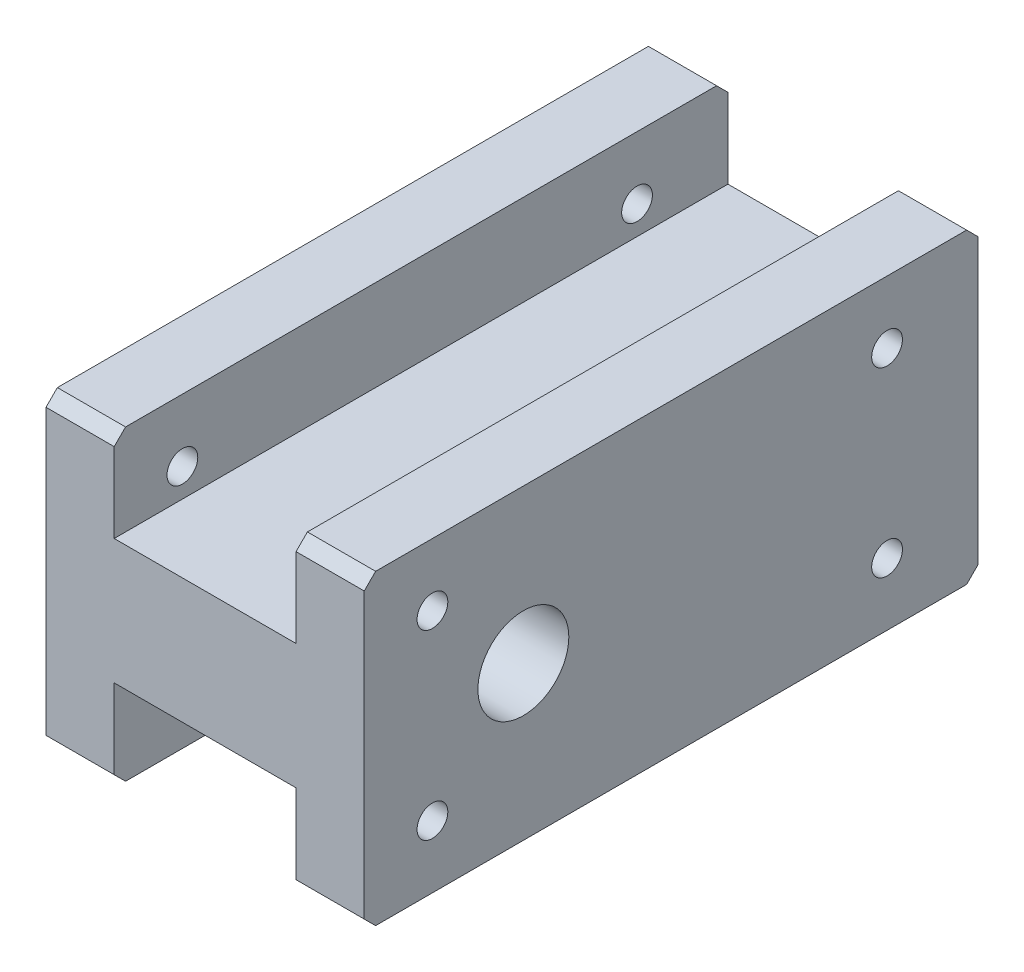
ISO-10303-21;
HEADER;
FILE_DESCRIPTION(('STEP AP214'),'2;1');
FILE_NAME('part.step','',(''),(''),'','','');
FILE_SCHEMA(('AUTOMOTIVE_DESIGN { 1 0 10303 214 1 1 1 1 }'));
ENDSEC;
DATA;
#1=APPLICATION_CONTEXT('core data for automotive mechanical design processes');
#2=APPLICATION_PROTOCOL_DEFINITION('international standard','automotive_design',2000,#1);
#3=PRODUCT_CONTEXT('',#1,'mechanical');
#4=PRODUCT('Part','Part','',(#3));
#5=PRODUCT_RELATED_PRODUCT_CATEGORY('part','',(#4));
#6=PRODUCT_DEFINITION_FORMATION('','',#4);
#7=PRODUCT_DEFINITION_CONTEXT('part definition',#1,'design');
#8=PRODUCT_DEFINITION('design','',#6,#7);
#9=PRODUCT_DEFINITION_SHAPE('','',#8);
#10=(LENGTH_UNIT() NAMED_UNIT(*) SI_UNIT(.MILLI.,.METRE.));
#11=(NAMED_UNIT(*) PLANE_ANGLE_UNIT() SI_UNIT($,.RADIAN.));
#12=(NAMED_UNIT(*) SI_UNIT($,.STERADIAN.) SOLID_ANGLE_UNIT());
#13=UNCERTAINTY_MEASURE_WITH_UNIT(LENGTH_MEASURE(1.E-05),#10,'distance_accuracy_value','');
#14=(GEOMETRIC_REPRESENTATION_CONTEXT(3) GLOBAL_UNCERTAINTY_ASSIGNED_CONTEXT((#13)) GLOBAL_UNIT_ASSIGNED_CONTEXT((#10,
#11,#12)) REPRESENTATION_CONTEXT('',''));
#15=CARTESIAN_POINT('',(0.,0.,0.));
#16=DIRECTION('',(0.,0.,1.));
#17=DIRECTION('',(1.,0.,0.));
#18=AXIS2_PLACEMENT_3D('',#15,#16,#17);
#19=CARTESIAN_POINT('',(-28.,-13.5,14.));
#20=DIRECTION('',(0.,-1.,0.));
#21=DIRECTION('',(0.,0.,-1.));
#22=AXIS2_PLACEMENT_3D('',#19,#20,#21);
#23=PLANE('',#22);
#24=DIRECTION('',(0.,0.,-1.));
#25=VECTOR('',#24,1.);
#26=CARTESIAN_POINT('',(-28.,-13.5,14.));
#27=LINE('',#26,#25);
#28=CARTESIAN_POINT('',(-28.,-13.5,13.));
#29=VERTEX_POINT('',#28);
#30=CARTESIAN_POINT('',(-28.,-13.5,-39.));
#31=VERTEX_POINT('',#30);
#32=EDGE_CURVE('E290',#29,#31,#27,.T.);
#33=ORIENTED_EDGE('',*,*,#32,.T.);
#34=DIRECTION('',(1.,0.,0.));
#35=VECTOR('',#34,1.);
#36=CARTESIAN_POINT('',(-28.,-13.5,-39.));
#37=LINE('',#36,#35);
#38=CARTESIAN_POINT('',(-22.,-13.5,-39.));
#39=VERTEX_POINT('',#38);
#40=EDGE_CURVE('E320',#31,#39,#37,.T.);
#41=ORIENTED_EDGE('',*,*,#40,.T.);
#42=DIRECTION('',(0.,0.,1.));
#43=VECTOR('',#42,1.);
#44=CARTESIAN_POINT('',(-22.,-13.5,-40.));
#45=LINE('',#44,#43);
#46=CARTESIAN_POINT('',(-22.,-13.5,13.));
#47=VERTEX_POINT('',#46);
#48=EDGE_CURVE('E199',#39,#47,#45,.T.);
#49=ORIENTED_EDGE('',*,*,#48,.T.);
#50=DIRECTION('',(-1.,0.,0.));
#51=VECTOR('',#50,1.);
#52=CARTESIAN_POINT('',(-28.,-13.5,13.));
#53=LINE('',#52,#51);
#54=EDGE_CURVE('E300',#47,#29,#53,.T.);
#55=ORIENTED_EDGE('',*,*,#54,.T.);
#56=EDGE_LOOP('',(#33,#41,#49,#55));
#57=FACE_BOUND('',#56,.T.);
#58=ADVANCED_FACE('F34',(#57),#23,.T.);
#59=CARTESIAN_POINT('',(0.,-8.,-32.));
#60=DIRECTION('',(1.,0.,0.));
#61=DIRECTION('',(0.,0.,-1.));
#62=AXIS2_PLACEMENT_3D('',#59,#60,#61);
#63=CYLINDRICAL_SURFACE('',#62,1.35254999999999);
#64=CARTESIAN_POINT('',(-22.,-8.,-32.));
#65=DIRECTION('',(-1.,0.,0.));
#66=DIRECTION('',(0.,0.,1.));
#67=AXIS2_PLACEMENT_3D('',#64,#65,#66);
#68=CIRCLE('',#67,1.35254999999999);
#69=CARTESIAN_POINT('',(-22.,-8.,-30.64745));
#70=VERTEX_POINT('',#69);
#71=EDGE_CURVE('E219',#70,#70,#68,.F.);
#72=ORIENTED_EDGE('',*,*,#71,.T.);
#73=EDGE_LOOP('',(#72));
#74=FACE_BOUND('',#73,.T.);
#75=CARTESIAN_POINT('',(-28.,-8.,-32.));
#76=DIRECTION('',(1.,0.,0.));
#77=DIRECTION('',(0.,0.,-1.));
#78=AXIS2_PLACEMENT_3D('',#75,#76,#77);
#79=CIRCLE('',#78,1.35254999999998);
#80=CARTESIAN_POINT('',(-28.,-8.,-33.35255));
#81=VERTEX_POINT('',#80);
#82=EDGE_CURVE('E271',#81,#81,#79,.T.);
#83=ORIENTED_EDGE('',*,*,#82,.F.);
#84=EDGE_LOOP('',(#83));
#85=FACE_BOUND('',#84,.T.);
#86=ADVANCED_FACE('F462',(#74,#85),#63,.F.);
#87=CARTESIAN_POINT('',(0.,-8.,8.));
#88=DIRECTION('',(1.,0.,0.));
#89=DIRECTION('',(0.,0.,-1.));
#90=AXIS2_PLACEMENT_3D('',#87,#88,#89);
#91=CYLINDRICAL_SURFACE('',#90,1.35254999999999);
#92=CARTESIAN_POINT('',(-22.,-8.,8.));
#93=DIRECTION('',(-1.,0.,0.));
#94=DIRECTION('',(0.,0.,1.));
#95=AXIS2_PLACEMENT_3D('',#92,#93,#94);
#96=CIRCLE('',#95,1.35254999999999);
#97=CARTESIAN_POINT('',(-22.,-8.,9.35254999999998));
#98=VERTEX_POINT('',#97);
#99=EDGE_CURVE('E218',#98,#98,#96,.F.);
#100=ORIENTED_EDGE('',*,*,#99,.T.);
#101=EDGE_LOOP('',(#100));
#102=FACE_BOUND('',#101,.T.);
#103=CARTESIAN_POINT('',(-28.,-8.,8.));
#104=DIRECTION('',(1.,0.,0.));
#105=DIRECTION('',(0.,0.,-1.));
#106=AXIS2_PLACEMENT_3D('',#103,#104,#105);
#107=CIRCLE('',#106,1.35254999999998);
#108=CARTESIAN_POINT('',(-28.,-8.,6.64745000000002));
#109=VERTEX_POINT('',#108);
#110=EDGE_CURVE('E265',#109,#109,#107,.T.);
#111=ORIENTED_EDGE('',*,*,#110,.F.);
#112=EDGE_LOOP('',(#111));
#113=FACE_BOUND('',#112,.T.);
#114=ADVANCED_FACE('F467',(#102,#113),#91,.F.);
#115=CARTESIAN_POINT('',(-28.,13.5,14.));
#116=DIRECTION('',(0.,1.,0.));
#117=DIRECTION('',(0.,0.,1.));
#118=AXIS2_PLACEMENT_3D('',#115,#116,#117);
#119=PLANE('',#118);
#120=DIRECTION('',(0.,0.,1.));
#121=VECTOR('',#120,1.);
#122=CARTESIAN_POINT('',(-22.,13.5,-40.));
#123=LINE('',#122,#121);
#124=CARTESIAN_POINT('',(-22.,13.5,-39.));
#125=VERTEX_POINT('',#124);
#126=CARTESIAN_POINT('',(-22.,13.5,13.));
#127=VERTEX_POINT('',#126);
#128=EDGE_CURVE('E239',#125,#127,#123,.T.);
#129=ORIENTED_EDGE('',*,*,#128,.F.);
#130=DIRECTION('',(-1.,0.,0.));
#131=VECTOR('',#130,1.);
#132=CARTESIAN_POINT('',(-28.,13.5,-39.));
#133=LINE('',#132,#131);
#134=CARTESIAN_POINT('',(-28.,13.5,-39.));
#135=VERTEX_POINT('',#134);
#136=EDGE_CURVE('E11',#125,#135,#133,.T.);
#137=ORIENTED_EDGE('',*,*,#136,.T.);
#138=DIRECTION('',(0.,0.,1.));
#139=VECTOR('',#138,1.);
#140=CARTESIAN_POINT('',(-28.,13.5,14.));
#141=LINE('',#140,#139);
#142=CARTESIAN_POINT('',(-28.,13.5,13.));
#143=VERTEX_POINT('',#142);
#144=EDGE_CURVE('E297',#135,#143,#141,.T.);
#145=ORIENTED_EDGE('',*,*,#144,.T.);
#146=DIRECTION('',(1.,0.,0.));
#147=VECTOR('',#146,1.);
#148=CARTESIAN_POINT('',(-28.,13.5,13.));
#149=LINE('',#148,#147);
#150=EDGE_CURVE('E42',#143,#127,#149,.T.);
#151=ORIENTED_EDGE('',*,*,#150,.T.);
#152=EDGE_LOOP('',(#129,#137,#145,#151));
#153=FACE_BOUND('',#152,.T.);
#154=ADVANCED_FACE('F382',(#153),#119,.T.);
#155=CARTESIAN_POINT('',(0.,8.,-32.));
#156=DIRECTION('',(1.,0.,0.));
#157=DIRECTION('',(0.,0.,-1.));
#158=AXIS2_PLACEMENT_3D('',#155,#156,#157);
#159=CYLINDRICAL_SURFACE('',#158,1.35254999999999);
#160=CARTESIAN_POINT('',(-22.,8.,-32.));
#161=DIRECTION('',(-1.,0.,0.));
#162=DIRECTION('',(0.,0.,1.));
#163=AXIS2_PLACEMENT_3D('',#160,#161,#162);
#164=CIRCLE('',#163,1.35254999999999);
#165=CARTESIAN_POINT('',(-22.,8.,-30.64745));
#166=VERTEX_POINT('',#165);
#167=EDGE_CURVE('E253',#166,#166,#164,.F.);
#168=ORIENTED_EDGE('',*,*,#167,.T.);
#169=EDGE_LOOP('',(#168));
#170=FACE_BOUND('',#169,.T.);
#171=CARTESIAN_POINT('',(-28.,8.,-32.));
#172=DIRECTION('',(1.,0.,0.));
#173=DIRECTION('',(0.,0.,-1.));
#174=AXIS2_PLACEMENT_3D('',#171,#172,#173);
#175=CIRCLE('',#174,1.35254999999998);
#176=CARTESIAN_POINT('',(-28.,8.,-33.35255));
#177=VERTEX_POINT('',#176);
#178=EDGE_CURVE('E277',#177,#177,#175,.T.);
#179=ORIENTED_EDGE('',*,*,#178,.F.);
#180=EDGE_LOOP('',(#179));
#181=FACE_BOUND('',#180,.T.);
#182=ADVANCED_FACE('F495',(#170,#181),#159,.F.);
#183=CARTESIAN_POINT('',(0.,8.,8.));
#184=DIRECTION('',(1.,0.,0.));
#185=DIRECTION('',(0.,0.,-1.));
#186=AXIS2_PLACEMENT_3D('',#183,#184,#185);
#187=CYLINDRICAL_SURFACE('',#186,1.35254999999999);
#188=CARTESIAN_POINT('',(-22.,8.,8.));
#189=DIRECTION('',(-1.,0.,0.));
#190=DIRECTION('',(0.,0.,1.));
#191=AXIS2_PLACEMENT_3D('',#188,#189,#190);
#192=CIRCLE('',#191,1.35254999999999);
#193=CARTESIAN_POINT('',(-22.,8.,9.35254999999999));
#194=VERTEX_POINT('',#193);
#195=EDGE_CURVE('E252',#194,#194,#192,.F.);
#196=ORIENTED_EDGE('',*,*,#195,.T.);
#197=EDGE_LOOP('',(#196));
#198=FACE_BOUND('',#197,.T.);
#199=CARTESIAN_POINT('',(-28.,8.,8.));
#200=DIRECTION('',(1.,0.,0.));
#201=DIRECTION('',(0.,0.,-1.));
#202=AXIS2_PLACEMENT_3D('',#199,#200,#201);
#203=CIRCLE('',#202,1.35254999999998);
#204=CARTESIAN_POINT('',(-28.,8.,6.64745000000002));
#205=VERTEX_POINT('',#204);
#206=EDGE_CURVE('E259',#205,#205,#203,.T.);
#207=ORIENTED_EDGE('',*,*,#206,.F.);
#208=EDGE_LOOP('',(#207));
#209=FACE_BOUND('',#208,.T.);
#210=ADVANCED_FACE('F507',(#198,#209),#187,.F.);
#211=CARTESIAN_POINT('',(-28.,13.5,14.));
#212=DIRECTION('',(0.,0.,1.));
#213=DIRECTION('',(0.,-1.,0.));
#214=AXIS2_PLACEMENT_3D('',#211,#212,#213);
#215=PLANE('',#214);
#216=DIRECTION('',(0.,1.,0.));
#217=VECTOR('',#216,1.);
#218=CARTESIAN_POINT('',(-6.,-13.5,14.));
#219=LINE('',#218,#217);
#220=CARTESIAN_POINT('',(-6.,-12.5,14.));
#221=VERTEX_POINT('',#220);
#222=CARTESIAN_POINT('',(-6.,-5.5,14.));
#223=VERTEX_POINT('',#222);
#224=EDGE_CURVE('E190',#221,#223,#219,.T.);
#225=ORIENTED_EDGE('',*,*,#224,.F.);
#226=DIRECTION('',(1.,0.,0.));
#227=VECTOR('',#226,1.);
#228=CARTESIAN_POINT('',(-28.,-12.5,14.));
#229=LINE('',#228,#227);
#230=CARTESIAN_POINT('',(0.,-12.5,14.));
#231=VERTEX_POINT('',#230);
#232=EDGE_CURVE('E368',#221,#231,#229,.T.);
#233=ORIENTED_EDGE('',*,*,#232,.T.);
#234=DIRECTION('',(0.,-1.,0.));
#235=VECTOR('',#234,1.);
#236=CARTESIAN_POINT('',(0.,13.5,14.));
#237=LINE('',#236,#235);
#238=CARTESIAN_POINT('',(0.,12.5,14.));
#239=VERTEX_POINT('',#238);
#240=EDGE_CURVE('E284',#239,#231,#237,.T.);
#241=ORIENTED_EDGE('',*,*,#240,.F.);
#242=DIRECTION('',(-1.,0.,0.));
#243=VECTOR('',#242,1.);
#244=CARTESIAN_POINT('',(-28.,12.5,14.));
#245=LINE('',#244,#243);
#246=CARTESIAN_POINT('',(-6.,12.5,14.));
#247=VERTEX_POINT('',#246);
#248=EDGE_CURVE('E363',#239,#247,#245,.T.);
#249=ORIENTED_EDGE('',*,*,#248,.T.);
#250=DIRECTION('',(0.,1.,0.));
#251=VECTOR('',#250,1.);
#252=CARTESIAN_POINT('',(-6.,13.5,14.));
#253=LINE('',#252,#251);
#254=CARTESIAN_POINT('',(-6.,5.5,14.));
#255=VERTEX_POINT('',#254);
#256=EDGE_CURVE('E226',#255,#247,#253,.T.);
#257=ORIENTED_EDGE('',*,*,#256,.F.);
#258=DIRECTION('',(1.,0.,0.));
#259=VECTOR('',#258,1.);
#260=CARTESIAN_POINT('',(-22.,5.5,14.));
#261=LINE('',#260,#259);
#262=CARTESIAN_POINT('',(-22.,5.5,14.));
#263=VERTEX_POINT('',#262);
#264=EDGE_CURVE('E234',#263,#255,#261,.T.);
#265=ORIENTED_EDGE('',*,*,#264,.F.);
#266=DIRECTION('',(0.,-1.,0.));
#267=VECTOR('',#266,1.);
#268=CARTESIAN_POINT('',(-22.,13.5,14.));
#269=LINE('',#268,#267);
#270=CARTESIAN_POINT('',(-22.,12.5,14.));
#271=VERTEX_POINT('',#270);
#272=EDGE_CURVE('E222',#271,#263,#269,.T.);
#273=ORIENTED_EDGE('',*,*,#272,.F.);
#274=DIRECTION('',(-1.,0.,0.));
#275=VECTOR('',#274,1.);
#276=CARTESIAN_POINT('',(-28.,12.5,14.));
#277=LINE('',#276,#275);
#278=CARTESIAN_POINT('',(-28.,12.5,14.));
#279=VERTEX_POINT('',#278);
#280=EDGE_CURVE('E361',#271,#279,#277,.T.);
#281=ORIENTED_EDGE('',*,*,#280,.T.);
#282=DIRECTION('',(0.,-1.,0.));
#283=VECTOR('',#282,1.);
#284=CARTESIAN_POINT('',(-28.,13.5,14.));
#285=LINE('',#284,#283);
#286=CARTESIAN_POINT('',(-28.,-12.5,14.));
#287=VERTEX_POINT('',#286);
#288=EDGE_CURVE('E287',#279,#287,#285,.T.);
#289=ORIENTED_EDGE('',*,*,#288,.T.);
#290=DIRECTION('',(1.,0.,0.));
#291=VECTOR('',#290,1.);
#292=CARTESIAN_POINT('',(-28.,-12.5,14.));
#293=LINE('',#292,#291);
#294=CARTESIAN_POINT('',(-22.,-12.5,14.));
#295=VERTEX_POINT('',#294);
#296=EDGE_CURVE('E365',#287,#295,#293,.T.);
#297=ORIENTED_EDGE('',*,*,#296,.T.);
#298=DIRECTION('',(0.,-1.,0.));
#299=VECTOR('',#298,1.);
#300=CARTESIAN_POINT('',(-22.,-13.5,14.));
#301=LINE('',#300,#299);
#302=CARTESIAN_POINT('',(-22.,-5.5,14.));
#303=VERTEX_POINT('',#302);
#304=EDGE_CURVE('E205',#303,#295,#301,.T.);
#305=ORIENTED_EDGE('',*,*,#304,.F.);
#306=DIRECTION('',(-1.,0.,0.));
#307=VECTOR('',#306,1.);
#308=CARTESIAN_POINT('',(-22.,-5.5,14.));
#309=LINE('',#308,#307);
#310=EDGE_CURVE('E209',#223,#303,#309,.T.);
#311=ORIENTED_EDGE('',*,*,#310,.F.);
#312=EDGE_LOOP('',(#225,#233,#241,#249,#257,#265,#273,#281,#289,#297,#305,#311));
#313=FACE_BOUND('',#312,.T.);
#314=ADVANCED_FACE('F392',(#313),#215,.T.);
#315=DIRECTION('',(0.,0.,1.));
#316=VECTOR('',#315,1.);
#317=CARTESIAN_POINT('',(0.,13.5,14.));
#318=LINE('',#317,#316);
#319=CARTESIAN_POINT('',(0.,13.5,-39.));
#320=VERTEX_POINT('',#319);
#321=CARTESIAN_POINT('',(0.,13.5,13.));
#322=VERTEX_POINT('',#321);
#323=EDGE_CURVE('E291',#320,#322,#318,.T.);
#324=ORIENTED_EDGE('',*,*,#323,.F.);
#325=DIRECTION('',(-1.,0.,0.));
#326=VECTOR('',#325,1.);
#327=CARTESIAN_POINT('',(-28.,13.5,-39.));
#328=LINE('',#327,#326);
#329=CARTESIAN_POINT('',(-6.,13.5,-39.));
#330=VERTEX_POINT('',#329);
#331=EDGE_CURVE('E374',#320,#330,#328,.T.);
#332=ORIENTED_EDGE('',*,*,#331,.T.);
#333=DIRECTION('',(0.,0.,1.));
#334=VECTOR('',#333,1.);
#335=CARTESIAN_POINT('',(-6.,13.5,-40.));
#336=LINE('',#335,#334);
#337=CARTESIAN_POINT('',(-6.,13.5,13.));
#338=VERTEX_POINT('',#337);
#339=EDGE_CURVE('E242',#330,#338,#336,.T.);
#340=ORIENTED_EDGE('',*,*,#339,.T.);
#341=DIRECTION('',(1.,0.,0.));
#342=VECTOR('',#341,1.);
#343=CARTESIAN_POINT('',(-28.,13.5,13.));
#344=LINE('',#343,#342);
#345=EDGE_CURVE('E371',#338,#322,#344,.T.);
#346=ORIENTED_EDGE('',*,*,#345,.T.);
#347=EDGE_LOOP('',(#324,#332,#340,#346));
#348=FACE_BOUND('',#347,.T.);
#349=ADVANCED_FACE('F433',(#348),#119,.T.);
#350=CARTESIAN_POINT('',(-28.,13.5,-40.));
#351=DIRECTION('',(0.,0.,-1.));
#352=DIRECTION('',(0.,1.,0.));
#353=AXIS2_PLACEMENT_3D('',#350,#351,#352);
#354=PLANE('',#353);
#355=DIRECTION('',(0.,-1.,0.));
#356=VECTOR('',#355,1.);
#357=CARTESIAN_POINT('',(-22.,-13.5,-40.));
#358=LINE('',#357,#356);
#359=CARTESIAN_POINT('',(-22.,-5.5,-40.));
#360=VERTEX_POINT('',#359);
#361=CARTESIAN_POINT('',(-22.,-12.5,-40.));
#362=VERTEX_POINT('',#361);
#363=EDGE_CURVE('E183',#360,#362,#358,.T.);
#364=ORIENTED_EDGE('',*,*,#363,.T.);
#365=DIRECTION('',(-1.,0.,0.));
#366=VECTOR('',#365,1.);
#367=CARTESIAN_POINT('',(-28.,-12.5,-40.));
#368=LINE('',#367,#366);
#369=CARTESIAN_POINT('',(-28.,-12.5,-40.));
#370=VERTEX_POINT('',#369);
#371=EDGE_CURVE('E334',#362,#370,#368,.T.);
#372=ORIENTED_EDGE('',*,*,#371,.T.);
#373=DIRECTION('',(0.,1.,0.));
#374=VECTOR('',#373,1.);
#375=CARTESIAN_POINT('',(-28.,13.5,-40.));
#376=LINE('',#375,#374);
#377=CARTESIAN_POINT('',(-28.,12.5,-40.));
#378=VERTEX_POINT('',#377);
#379=EDGE_CURVE('E294',#370,#378,#376,.T.);
#380=ORIENTED_EDGE('',*,*,#379,.T.);
#381=DIRECTION('',(1.,0.,0.));
#382=VECTOR('',#381,1.);
#383=CARTESIAN_POINT('',(-28.,12.5,-40.));
#384=LINE('',#383,#382);
#385=CARTESIAN_POINT('',(-22.,12.5,-40.));
#386=VERTEX_POINT('',#385);
#387=EDGE_CURVE('E327',#378,#386,#384,.T.);
#388=ORIENTED_EDGE('',*,*,#387,.T.);
#389=DIRECTION('',(0.,-1.,0.));
#390=VECTOR('',#389,1.);
#391=CARTESIAN_POINT('',(-22.,13.5,-40.));
#392=LINE('',#391,#390);
#393=CARTESIAN_POINT('',(-22.,5.5,-40.));
#394=VERTEX_POINT('',#393);
#395=EDGE_CURVE('E223',#386,#394,#392,.T.);
#396=ORIENTED_EDGE('',*,*,#395,.T.);
#397=DIRECTION('',(1.,0.,0.));
#398=VECTOR('',#397,1.);
#399=CARTESIAN_POINT('',(-22.,5.5,-40.));
#400=LINE('',#399,#398);
#401=CARTESIAN_POINT('',(-6.,5.5,-40.));
#402=VERTEX_POINT('',#401);
#403=EDGE_CURVE('E225',#394,#402,#400,.T.);
#404=ORIENTED_EDGE('',*,*,#403,.T.);
#405=DIRECTION('',(0.,1.,0.));
#406=VECTOR('',#405,1.);
#407=CARTESIAN_POINT('',(-6.,13.5,-40.));
#408=LINE('',#407,#406);
#409=CARTESIAN_POINT('',(-6.,12.5,-40.));
#410=VERTEX_POINT('',#409);
#411=EDGE_CURVE('E229',#402,#410,#408,.T.);
#412=ORIENTED_EDGE('',*,*,#411,.T.);
#413=DIRECTION('',(1.,0.,0.));
#414=VECTOR('',#413,1.);
#415=CARTESIAN_POINT('',(-28.,12.5,-40.));
#416=LINE('',#415,#414);
#417=CARTESIAN_POINT('',(0.,12.5,-40.));
#418=VERTEX_POINT('',#417);
#419=EDGE_CURVE('E330',#410,#418,#416,.T.);
#420=ORIENTED_EDGE('',*,*,#419,.T.);
#421=DIRECTION('',(0.,1.,0.));
#422=VECTOR('',#421,1.);
#423=CARTESIAN_POINT('',(0.,13.5,-40.));
#424=LINE('',#423,#422);
#425=CARTESIAN_POINT('',(0.,-12.5,-40.));
#426=VERTEX_POINT('',#425);
#427=EDGE_CURVE('E306',#426,#418,#424,.T.);
#428=ORIENTED_EDGE('',*,*,#427,.F.);
#429=DIRECTION('',(-1.,0.,0.));
#430=VECTOR('',#429,1.);
#431=CARTESIAN_POINT('',(-28.,-12.5,-40.));
#432=LINE('',#431,#430);
#433=CARTESIAN_POINT('',(-6.,-12.5,-40.));
#434=VERTEX_POINT('',#433);
#435=EDGE_CURVE('E180',#426,#434,#432,.T.);
#436=ORIENTED_EDGE('',*,*,#435,.T.);
#437=DIRECTION('',(0.,1.,0.));
#438=VECTOR('',#437,1.);
#439=CARTESIAN_POINT('',(-6.,-13.5,-40.));
#440=LINE('',#439,#438);
#441=CARTESIAN_POINT('',(-6.,-5.5,-40.));
#442=VERTEX_POINT('',#441);
#443=EDGE_CURVE('E172',#434,#442,#440,.T.);
#444=ORIENTED_EDGE('',*,*,#443,.T.);
#445=DIRECTION('',(-1.,0.,0.));
#446=VECTOR('',#445,1.);
#447=CARTESIAN_POINT('',(-22.,-5.5,-40.));
#448=LINE('',#447,#446);
#449=EDGE_CURVE('E177',#442,#360,#448,.T.);
#450=ORIENTED_EDGE('',*,*,#449,.T.);
#451=EDGE_LOOP('',(#364,#372,#380,#388,#396,#404,#412,#420,#428,#436,#444,#450));
#452=FACE_BOUND('',#451,.T.);
#453=ADVANCED_FACE('F175',(#452),#354,.T.);
#454=DIRECTION('',(0.,0.,1.));
#455=VECTOR('',#454,1.);
#456=CARTESIAN_POINT('',(-6.,-13.5,-40.));
#457=LINE('',#456,#455);
#458=CARTESIAN_POINT('',(-6.,-13.5,-39.));
#459=VERTEX_POINT('',#458);
#460=CARTESIAN_POINT('',(-6.,-13.5,13.));
#461=VERTEX_POINT('',#460);
#462=EDGE_CURVE('E195',#459,#461,#457,.T.);
#463=ORIENTED_EDGE('',*,*,#462,.F.);
#464=DIRECTION('',(1.,0.,0.));
#465=VECTOR('',#464,1.);
#466=CARTESIAN_POINT('',(-28.,-13.5,-39.));
#467=LINE('',#466,#465);
#468=CARTESIAN_POINT('',(0.,-13.5,-39.));
#469=VERTEX_POINT('',#468);
#470=EDGE_CURVE('E346',#459,#469,#467,.T.);
#471=ORIENTED_EDGE('',*,*,#470,.T.);
#472=DIRECTION('',(0.,0.,-1.));
#473=VECTOR('',#472,1.);
#474=CARTESIAN_POINT('',(0.,-13.5,14.));
#475=LINE('',#474,#473);
#476=CARTESIAN_POINT('',(0.,-13.5,13.));
#477=VERTEX_POINT('',#476);
#478=EDGE_CURVE('E303',#477,#469,#475,.T.);
#479=ORIENTED_EDGE('',*,*,#478,.F.);
#480=DIRECTION('',(-1.,0.,0.));
#481=VECTOR('',#480,1.);
#482=CARTESIAN_POINT('',(-28.,-13.5,13.));
#483=LINE('',#482,#481);
#484=EDGE_CURVE('E344',#477,#461,#483,.T.);
#485=ORIENTED_EDGE('',*,*,#484,.T.);
#486=EDGE_LOOP('',(#463,#471,#479,#485));
#487=FACE_BOUND('',#486,.T.);
#488=ADVANCED_FACE('F449',(#487),#23,.T.);
#489=CARTESIAN_POINT('',(-28.,0.,0.));
#490=DIRECTION('',(1.,0.,0.));
#491=DIRECTION('',(0.,0.,-1.));
#492=AXIS2_PLACEMENT_3D('',#489,#490,#491);
#493=PLANE('',#492);
#494=ORIENTED_EDGE('',*,*,#206,.T.);
#495=EDGE_LOOP('',(#494));
#496=FACE_BOUND('',#495,.T.);
#497=ORIENTED_EDGE('',*,*,#110,.T.);
#498=EDGE_LOOP('',(#497));
#499=FACE_BOUND('',#498,.T.);
#500=ORIENTED_EDGE('',*,*,#82,.T.);
#501=EDGE_LOOP('',(#500));
#502=FACE_BOUND('',#501,.T.);
#503=ORIENTED_EDGE('',*,*,#178,.T.);
#504=EDGE_LOOP('',(#503));
#505=FACE_BOUND('',#504,.T.);
#506=CARTESIAN_POINT('',(-28.,0.,0.));
#507=DIRECTION('',(1.,0.,0.));
#508=DIRECTION('',(0.,0.,-1.));
#509=AXIS2_PLACEMENT_3D('',#506,#507,#508);
#510=CIRCLE('',#509,4.);
#511=CARTESIAN_POINT('',(-28.,0.,-4.));
#512=VERTEX_POINT('',#511);
#513=EDGE_CURVE('E281',#512,#512,#510,.T.);
#514=ORIENTED_EDGE('',*,*,#513,.T.);
#515=EDGE_LOOP('',(#514));
#516=FACE_BOUND('',#515,.T.);
#517=ORIENTED_EDGE('',*,*,#379,.F.);
#518=DIRECTION('',(0.,0.707106781186545,-0.70710678118655));
#519=VECTOR('',#518,1.);
#520=CARTESIAN_POINT('',(-28.,-13.5,-39.));
#521=LINE('',#520,#519);
#522=EDGE_CURVE('E342',#370,#31,#521,.F.);
#523=ORIENTED_EDGE('',*,*,#522,.T.);
#524=ORIENTED_EDGE('',*,*,#32,.F.);
#525=DIRECTION('',(0.,-0.707106781186545,-0.70710678118655));
#526=VECTOR('',#525,1.);
#527=CARTESIAN_POINT('',(-28.,-12.5,14.));
#528=LINE('',#527,#526);
#529=EDGE_CURVE('E340',#29,#287,#528,.F.);
#530=ORIENTED_EDGE('',*,*,#529,.T.);
#531=ORIENTED_EDGE('',*,*,#288,.F.);
#532=DIRECTION('',(0.,-0.707106781186548,0.707106781186548));
#533=VECTOR('',#532,1.);
#534=CARTESIAN_POINT('',(-28.,13.5,13.));
#535=LINE('',#534,#533);
#536=EDGE_CURVE('E336',#279,#143,#535,.F.);
#537=ORIENTED_EDGE('',*,*,#536,.T.);
#538=ORIENTED_EDGE('',*,*,#144,.F.);
#539=DIRECTION('',(0.,0.707106781186545,0.70710678118655));
#540=VECTOR('',#539,1.);
#541=CARTESIAN_POINT('',(-28.,12.5,-40.));
#542=LINE('',#541,#540);
#543=EDGE_CURVE('E338',#135,#378,#542,.F.);
#544=ORIENTED_EDGE('',*,*,#543,.T.);
#545=EDGE_LOOP('',(#517,#523,#524,#530,#531,#537,#538,#544));
#546=FACE_BOUND('',#545,.T.);
#547=ADVANCED_FACE('F397',(#496,#499,#502,#505,#516,#546),#493,.F.);
#548=CARTESIAN_POINT('',(0.,0.,0.));
#549=DIRECTION('',(1.,0.,0.));
#550=DIRECTION('',(0.,0.,-1.));
#551=AXIS2_PLACEMENT_3D('',#548,#549,#550);
#552=PLANE('',#551);
#553=CARTESIAN_POINT('',(0.,8.,8.));
#554=DIRECTION('',(1.,0.,0.));
#555=DIRECTION('',(0.,0.,-1.));
#556=AXIS2_PLACEMENT_3D('',#553,#554,#555);
#557=CIRCLE('',#556,1.35254999999999);
#558=CARTESIAN_POINT('',(0.,8.,6.64745000000002));
#559=VERTEX_POINT('',#558);
#560=EDGE_CURVE('E256',#559,#559,#557,.T.);
#561=ORIENTED_EDGE('',*,*,#560,.F.);
#562=EDGE_LOOP('',(#561));
#563=FACE_BOUND('',#562,.T.);
#564=CARTESIAN_POINT('',(0.,-8.,8.));
#565=DIRECTION('',(1.,0.,0.));
#566=DIRECTION('',(0.,0.,-1.));
#567=AXIS2_PLACEMENT_3D('',#564,#565,#566);
#568=CIRCLE('',#567,1.35254999999999);
#569=CARTESIAN_POINT('',(0.,-8.,6.64745000000001));
#570=VERTEX_POINT('',#569);
#571=EDGE_CURVE('E262',#570,#570,#568,.T.);
#572=ORIENTED_EDGE('',*,*,#571,.F.);
#573=EDGE_LOOP('',(#572));
#574=FACE_BOUND('',#573,.T.);
#575=CARTESIAN_POINT('',(0.,-8.,-32.));
#576=DIRECTION('',(1.,0.,0.));
#577=DIRECTION('',(0.,0.,-1.));
#578=AXIS2_PLACEMENT_3D('',#575,#576,#577);
#579=CIRCLE('',#578,1.35254999999999);
#580=CARTESIAN_POINT('',(0.,-8.,-33.35255));
#581=VERTEX_POINT('',#580);
#582=EDGE_CURVE('E268',#581,#581,#579,.T.);
#583=ORIENTED_EDGE('',*,*,#582,.F.);
#584=EDGE_LOOP('',(#583));
#585=FACE_BOUND('',#584,.T.);
#586=CARTESIAN_POINT('',(0.,8.,-32.));
#587=DIRECTION('',(1.,0.,0.));
#588=DIRECTION('',(0.,0.,-1.));
#589=AXIS2_PLACEMENT_3D('',#586,#587,#588);
#590=CIRCLE('',#589,1.35254999999999);
#591=CARTESIAN_POINT('',(0.,8.,-33.35255));
#592=VERTEX_POINT('',#591);
#593=EDGE_CURVE('E274',#592,#592,#590,.T.);
#594=ORIENTED_EDGE('',*,*,#593,.F.);
#595=EDGE_LOOP('',(#594));
#596=FACE_BOUND('',#595,.T.);
#597=CARTESIAN_POINT('',(0.,0.,0.));
#598=DIRECTION('',(1.,0.,0.));
#599=DIRECTION('',(0.,0.,-1.));
#600=AXIS2_PLACEMENT_3D('',#597,#598,#599);
#601=CIRCLE('',#600,4.);
#602=CARTESIAN_POINT('',(0.,0.,-4.));
#603=VERTEX_POINT('',#602);
#604=EDGE_CURVE('E280',#603,#603,#601,.T.);
#605=ORIENTED_EDGE('',*,*,#604,.F.);
#606=EDGE_LOOP('',(#605));
#607=FACE_BOUND('',#606,.T.);
#608=ORIENTED_EDGE('',*,*,#478,.T.);
#609=DIRECTION('',(0.,-0.707106781186545,0.70710678118655));
#610=VECTOR('',#609,1.);
#611=CARTESIAN_POINT('',(0.,-26.25,-26.2499999999999));
#612=LINE('',#611,#610);
#613=EDGE_CURVE('E355',#469,#426,#612,.F.);
#614=ORIENTED_EDGE('',*,*,#613,.T.);
#615=ORIENTED_EDGE('',*,*,#427,.T.);
#616=DIRECTION('',(0.,-0.707106781186545,-0.70710678118655));
#617=VECTOR('',#616,1.);
#618=CARTESIAN_POINT('',(0.,26.25,-26.2499999999999));
#619=LINE('',#618,#617);
#620=EDGE_CURVE('E351',#418,#320,#619,.F.);
#621=ORIENTED_EDGE('',*,*,#620,.T.);
#622=ORIENTED_EDGE('',*,*,#323,.T.);
#623=DIRECTION('',(0.,0.707106781186548,-0.707106781186548));
#624=VECTOR('',#623,1.);
#625=CARTESIAN_POINT('',(0.,13.25,13.25));
#626=LINE('',#625,#624);
#627=EDGE_CURVE('E349',#322,#239,#626,.F.);
#628=ORIENTED_EDGE('',*,*,#627,.T.);
#629=ORIENTED_EDGE('',*,*,#240,.T.);
#630=DIRECTION('',(0.,0.707106781186545,0.70710678118655));
#631=VECTOR('',#630,1.);
#632=CARTESIAN_POINT('',(0.,-13.25,13.2499999999999));
#633=LINE('',#632,#631);
#634=EDGE_CURVE('E353',#231,#477,#633,.F.);
#635=ORIENTED_EDGE('',*,*,#634,.T.);
#636=EDGE_LOOP('',(#608,#614,#615,#621,#622,#628,#629,#635));
#637=FACE_BOUND('',#636,.T.);
#638=ADVANCED_FACE('F431',(#563,#574,#585,#596,#607,#637),#552,.T.);
#639=CARTESIAN_POINT('',(-28.,0.,0.));
#640=DIRECTION('',(1.,0.,0.));
#641=DIRECTION('',(0.,0.,-1.));
#642=AXIS2_PLACEMENT_3D('',#639,#640,#641);
#643=CYLINDRICAL_SURFACE('',#642,4.);
#644=ORIENTED_EDGE('',*,*,#513,.F.);
#645=EDGE_LOOP('',(#644));
#646=FACE_BOUND('',#645,.T.);
#647=ORIENTED_EDGE('',*,*,#604,.T.);
#648=EDGE_LOOP('',(#647));
#649=FACE_BOUND('',#648,.T.);
#650=ADVANCED_FACE('F486',(#646,#649),#643,.F.);
#651=CARTESIAN_POINT('',(-6.,8.,-32.));
#652=DIRECTION('',(1.,0.,0.));
#653=DIRECTION('',(0.,1.,0.));
#654=AXIS2_PLACEMENT_3D('',#651,#652,#653);
#655=CIRCLE('',#654,1.35254999999999);
#656=CARTESIAN_POINT('',(-6.,9.35254999999998,-32.));
#657=VERTEX_POINT('',#656);
#658=EDGE_CURVE('E249',#657,#657,#655,.F.);
#659=ORIENTED_EDGE('',*,*,#658,.T.);
#660=EDGE_LOOP('',(#659));
#661=FACE_BOUND('',#660,.T.);
#662=ORIENTED_EDGE('',*,*,#593,.T.);
#663=EDGE_LOOP('',(#662));
#664=FACE_BOUND('',#663,.T.);
#665=ADVANCED_FACE('F491',(#661,#664),#159,.F.);
#666=CARTESIAN_POINT('',(-6.,-8.,-32.));
#667=DIRECTION('',(1.,0.,0.));
#668=DIRECTION('',(0.,1.,0.));
#669=AXIS2_PLACEMENT_3D('',#666,#667,#668);
#670=CIRCLE('',#669,1.35254999999999);
#671=CARTESIAN_POINT('',(-6.,-6.64745000000002,-32.));
#672=VERTEX_POINT('',#671);
#673=EDGE_CURVE('E215',#672,#672,#670,.F.);
#674=ORIENTED_EDGE('',*,*,#673,.T.);
#675=EDGE_LOOP('',(#674));
#676=FACE_BOUND('',#675,.T.);
#677=ORIENTED_EDGE('',*,*,#582,.T.);
#678=EDGE_LOOP('',(#677));
#679=FACE_BOUND('',#678,.T.);
#680=ADVANCED_FACE('F470',(#676,#679),#63,.F.);
#681=CARTESIAN_POINT('',(-6.,-8.,8.));
#682=DIRECTION('',(1.,0.,0.));
#683=DIRECTION('',(0.,1.,0.));
#684=AXIS2_PLACEMENT_3D('',#681,#682,#683);
#685=CIRCLE('',#684,1.35254999999999);
#686=CARTESIAN_POINT('',(-6.,-6.64745000000002,8.));
#687=VERTEX_POINT('',#686);
#688=EDGE_CURVE('E211',#687,#687,#685,.F.);
#689=ORIENTED_EDGE('',*,*,#688,.T.);
#690=EDGE_LOOP('',(#689));
#691=FACE_BOUND('',#690,.T.);
#692=ORIENTED_EDGE('',*,*,#571,.T.);
#693=EDGE_LOOP('',(#692));
#694=FACE_BOUND('',#693,.T.);
#695=ADVANCED_FACE('F498',(#691,#694),#91,.F.);
#696=CARTESIAN_POINT('',(-6.,8.,8.));
#697=DIRECTION('',(1.,0.,0.));
#698=DIRECTION('',(0.,1.,0.));
#699=AXIS2_PLACEMENT_3D('',#696,#697,#698);
#700=CIRCLE('',#699,1.35254999999999);
#701=CARTESIAN_POINT('',(-6.,9.35254999999998,8.));
#702=VERTEX_POINT('',#701);
#703=EDGE_CURVE('E241',#702,#702,#700,.F.);
#704=ORIENTED_EDGE('',*,*,#703,.T.);
#705=EDGE_LOOP('',(#704));
#706=FACE_BOUND('',#705,.T.);
#707=ORIENTED_EDGE('',*,*,#560,.T.);
#708=EDGE_LOOP('',(#707));
#709=FACE_BOUND('',#708,.T.);
#710=ADVANCED_FACE('F502',(#706,#709),#187,.F.);
#711=CARTESIAN_POINT('',(-22.,13.5,-40.));
#712=DIRECTION('',(-1.,0.,0.));
#713=DIRECTION('',(0.,0.,1.));
#714=AXIS2_PLACEMENT_3D('',#711,#712,#713);
#715=PLANE('',#714);
#716=ORIENTED_EDGE('',*,*,#195,.F.);
#717=EDGE_LOOP('',(#716));
#718=FACE_BOUND('',#717,.T.);
#719=ORIENTED_EDGE('',*,*,#395,.F.);
#720=DIRECTION('',(0.,-0.707106781186545,-0.70710678118655));
#721=VECTOR('',#720,1.);
#722=CARTESIAN_POINT('',(-22.,12.5,-40.));
#723=LINE('',#722,#721);
#724=EDGE_CURVE('E57',#386,#125,#723,.F.);
#725=ORIENTED_EDGE('',*,*,#724,.T.);
#726=ORIENTED_EDGE('',*,*,#128,.T.);
#727=DIRECTION('',(0.,0.707106781186548,-0.707106781186548));
#728=VECTOR('',#727,1.);
#729=CARTESIAN_POINT('',(-22.,13.5,13.));
#730=LINE('',#729,#728);
#731=EDGE_CURVE('E49',#127,#271,#730,.F.);
#732=ORIENTED_EDGE('',*,*,#731,.T.);
#733=ORIENTED_EDGE('',*,*,#272,.T.);
#734=DIRECTION('',(0.,0.,1.));
#735=VECTOR('',#734,1.);
#736=CARTESIAN_POINT('',(-22.,5.5,-40.));
#737=LINE('',#736,#735);
#738=EDGE_CURVE('E232',#394,#263,#737,.T.);
#739=ORIENTED_EDGE('',*,*,#738,.F.);
#740=EDGE_LOOP('',(#719,#725,#726,#732,#733,#739));
#741=FACE_BOUND('',#740,.T.);
#742=ORIENTED_EDGE('',*,*,#167,.F.);
#743=EDGE_LOOP('',(#742));
#744=FACE_BOUND('',#743,.T.);
#745=ADVANCED_FACE('F386',(#718,#741,#744),#715,.F.);
#746=CARTESIAN_POINT('',(-6.,13.5,-40.));
#747=DIRECTION('',(1.,0.,0.));
#748=DIRECTION('',(0.,1.,0.));
#749=AXIS2_PLACEMENT_3D('',#746,#747,#748);
#750=PLANE('',#749);
#751=ORIENTED_EDGE('',*,*,#703,.F.);
#752=EDGE_LOOP('',(#751));
#753=FACE_BOUND('',#752,.T.);
#754=ORIENTED_EDGE('',*,*,#339,.F.);
#755=DIRECTION('',(0.,0.707106781186545,0.70710678118655));
#756=VECTOR('',#755,1.);
#757=CARTESIAN_POINT('',(-6.,12.5,-40.));
#758=LINE('',#757,#756);
#759=EDGE_CURVE('E378',#330,#410,#758,.F.);
#760=ORIENTED_EDGE('',*,*,#759,.T.);
#761=ORIENTED_EDGE('',*,*,#411,.F.);
#762=DIRECTION('',(0.,0.,1.));
#763=VECTOR('',#762,1.);
#764=CARTESIAN_POINT('',(-6.,5.5,-40.));
#765=LINE('',#764,#763);
#766=EDGE_CURVE('E245',#402,#255,#765,.T.);
#767=ORIENTED_EDGE('',*,*,#766,.T.);
#768=ORIENTED_EDGE('',*,*,#256,.T.);
#769=DIRECTION('',(0.,-0.707106781186548,0.707106781186548));
#770=VECTOR('',#769,1.);
#771=CARTESIAN_POINT('',(-6.,13.5,13.));
#772=LINE('',#771,#770);
#773=EDGE_CURVE('E376',#247,#338,#772,.F.);
#774=ORIENTED_EDGE('',*,*,#773,.T.);
#775=EDGE_LOOP('',(#754,#760,#761,#767,#768,#774));
#776=FACE_BOUND('',#775,.T.);
#777=ORIENTED_EDGE('',*,*,#658,.F.);
#778=EDGE_LOOP('',(#777));
#779=FACE_BOUND('',#778,.T.);
#780=ADVANCED_FACE('F510',(#753,#776,#779),#750,.F.);
#781=CARTESIAN_POINT('',(-22.,5.5,-40.));
#782=DIRECTION('',(0.,-1.,0.));
#783=DIRECTION('',(0.,0.,-1.));
#784=AXIS2_PLACEMENT_3D('',#781,#782,#783);
#785=PLANE('',#784);
#786=ORIENTED_EDGE('',*,*,#264,.T.);
#787=ORIENTED_EDGE('',*,*,#766,.F.);
#788=ORIENTED_EDGE('',*,*,#403,.F.);
#789=ORIENTED_EDGE('',*,*,#738,.T.);
#790=EDGE_LOOP('',(#786,#787,#788,#789));
#791=FACE_BOUND('',#790,.T.);
#792=ADVANCED_FACE('F422',(#791),#785,.F.);
#793=CARTESIAN_POINT('',(-22.,-13.5,-40.));
#794=DIRECTION('',(-1.,0.,0.));
#795=DIRECTION('',(0.,0.,1.));
#796=AXIS2_PLACEMENT_3D('',#793,#794,#795);
#797=PLANE('',#796);
#798=ORIENTED_EDGE('',*,*,#99,.F.);
#799=EDGE_LOOP('',(#798));
#800=FACE_BOUND('',#799,.T.);
#801=ORIENTED_EDGE('',*,*,#48,.F.);
#802=DIRECTION('',(0.,-0.707106781186545,0.70710678118655));
#803=VECTOR('',#802,1.);
#804=CARTESIAN_POINT('',(-22.,-13.5,-39.));
#805=LINE('',#804,#803);
#806=EDGE_CURVE('E325',#39,#362,#805,.F.);
#807=ORIENTED_EDGE('',*,*,#806,.T.);
#808=ORIENTED_EDGE('',*,*,#363,.F.);
#809=DIRECTION('',(0.,0.,1.));
#810=VECTOR('',#809,1.);
#811=CARTESIAN_POINT('',(-22.,-5.5,-40.));
#812=LINE('',#811,#810);
#813=EDGE_CURVE('E194',#360,#303,#812,.T.);
#814=ORIENTED_EDGE('',*,*,#813,.T.);
#815=ORIENTED_EDGE('',*,*,#304,.T.);
#816=DIRECTION('',(0.,0.707106781186545,0.70710678118655));
#817=VECTOR('',#816,1.);
#818=CARTESIAN_POINT('',(-22.,-12.5,14.));
#819=LINE('',#818,#817);
#820=EDGE_CURVE('E323',#295,#47,#819,.F.);
#821=ORIENTED_EDGE('',*,*,#820,.T.);
#822=EDGE_LOOP('',(#801,#807,#808,#814,#815,#821));
#823=FACE_BOUND('',#822,.T.);
#824=ORIENTED_EDGE('',*,*,#71,.F.);
#825=EDGE_LOOP('',(#824));
#826=FACE_BOUND('',#825,.T.);
#827=ADVANCED_FACE('F408',(#800,#823,#826),#797,.F.);
#828=CARTESIAN_POINT('',(-6.,-13.5,-40.));
#829=DIRECTION('',(1.,0.,0.));
#830=DIRECTION('',(0.,1.,0.));
#831=AXIS2_PLACEMENT_3D('',#828,#829,#830);
#832=PLANE('',#831);
#833=ORIENTED_EDGE('',*,*,#688,.F.);
#834=EDGE_LOOP('',(#833));
#835=FACE_BOUND('',#834,.T.);
#836=ORIENTED_EDGE('',*,*,#443,.F.);
#837=DIRECTION('',(0.,0.707106781186545,-0.70710678118655));
#838=VECTOR('',#837,1.);
#839=CARTESIAN_POINT('',(-5.99999999999999,-13.5,-39.));
#840=LINE('',#839,#838);
#841=EDGE_CURVE('E359',#434,#459,#840,.F.);
#842=ORIENTED_EDGE('',*,*,#841,.T.);
#843=ORIENTED_EDGE('',*,*,#462,.T.);
#844=DIRECTION('',(0.,-0.707106781186545,-0.70710678118655));
#845=VECTOR('',#844,1.);
#846=CARTESIAN_POINT('',(-5.99999999999999,-12.5,14.));
#847=LINE('',#846,#845);
#848=EDGE_CURVE('E357',#461,#221,#847,.F.);
#849=ORIENTED_EDGE('',*,*,#848,.T.);
#850=ORIENTED_EDGE('',*,*,#224,.T.);
#851=DIRECTION('',(0.,0.,1.));
#852=VECTOR('',#851,1.);
#853=CARTESIAN_POINT('',(-6.,-5.5,-40.));
#854=LINE('',#853,#852);
#855=EDGE_CURVE('E186',#442,#223,#854,.T.);
#856=ORIENTED_EDGE('',*,*,#855,.F.);
#857=EDGE_LOOP('',(#836,#842,#843,#849,#850,#856));
#858=FACE_BOUND('',#857,.T.);
#859=ORIENTED_EDGE('',*,*,#673,.F.);
#860=EDGE_LOOP('',(#859));
#861=FACE_BOUND('',#860,.T.);
#862=ADVANCED_FACE('F187',(#835,#858,#861),#832,.F.);
#863=CARTESIAN_POINT('',(-22.,-5.5,-40.));
#864=DIRECTION('',(0.,1.,0.));
#865=DIRECTION('',(0.,0.,1.));
#866=AXIS2_PLACEMENT_3D('',#863,#864,#865);
#867=PLANE('',#866);
#868=ORIENTED_EDGE('',*,*,#310,.T.);
#869=ORIENTED_EDGE('',*,*,#813,.F.);
#870=ORIENTED_EDGE('',*,*,#449,.F.);
#871=ORIENTED_EDGE('',*,*,#855,.T.);
#872=EDGE_LOOP('',(#868,#869,#870,#871));
#873=FACE_BOUND('',#872,.T.);
#874=ADVANCED_FACE('F197',(#873),#867,.F.);
#875=CARTESIAN_POINT('',(-28.,-13.5,-39.));
#876=DIRECTION('',(0.,0.70710678118655,0.707106781186545));
#877=DIRECTION('',(1.,0.,0.));
#878=AXIS2_PLACEMENT_3D('',#875,#876,#877);
#879=PLANE('',#878);
#880=ORIENTED_EDGE('',*,*,#522,.F.);
#881=ORIENTED_EDGE('',*,*,#371,.F.);
#882=ORIENTED_EDGE('',*,*,#806,.F.);
#883=ORIENTED_EDGE('',*,*,#40,.F.);
#884=EDGE_LOOP('',(#880,#881,#882,#883));
#885=FACE_BOUND('',#884,.T.);
#886=ADVANCED_FACE('F414',(#885),#879,.F.);
#887=CARTESIAN_POINT('',(-28.,-13.5,-39.));
#888=DIRECTION('',(0.,0.70710678118655,0.707106781186545));
#889=DIRECTION('',(1.,0.,0.));
#890=AXIS2_PLACEMENT_3D('',#887,#888,#889);
#891=PLANE('',#890);
#892=ORIENTED_EDGE('',*,*,#841,.F.);
#893=ORIENTED_EDGE('',*,*,#435,.F.);
#894=ORIENTED_EDGE('',*,*,#613,.F.);
#895=ORIENTED_EDGE('',*,*,#470,.F.);
#896=EDGE_LOOP('',(#892,#893,#894,#895));
#897=FACE_BOUND('',#896,.T.);
#898=ADVANCED_FACE('F452',(#897),#891,.F.);
#899=CARTESIAN_POINT('',(-28.,-12.5,14.));
#900=DIRECTION('',(0.,0.70710678118655,-0.707106781186545));
#901=DIRECTION('',(1.,0.,0.));
#902=AXIS2_PLACEMENT_3D('',#899,#900,#901);
#903=PLANE('',#902);
#904=ORIENTED_EDGE('',*,*,#848,.F.);
#905=ORIENTED_EDGE('',*,*,#484,.F.);
#906=ORIENTED_EDGE('',*,*,#634,.F.);
#907=ORIENTED_EDGE('',*,*,#232,.F.);
#908=EDGE_LOOP('',(#904,#905,#906,#907));
#909=FACE_BOUND('',#908,.T.);
#910=ADVANCED_FACE('F444',(#909),#903,.F.);
#911=CARTESIAN_POINT('',(-28.,-12.5,14.));
#912=DIRECTION('',(0.,0.70710678118655,-0.707106781186545));
#913=DIRECTION('',(1.,0.,0.));
#914=AXIS2_PLACEMENT_3D('',#911,#912,#913);
#915=PLANE('',#914);
#916=ORIENTED_EDGE('',*,*,#529,.F.);
#917=ORIENTED_EDGE('',*,*,#54,.F.);
#918=ORIENTED_EDGE('',*,*,#820,.F.);
#919=ORIENTED_EDGE('',*,*,#296,.F.);
#920=EDGE_LOOP('',(#916,#917,#918,#919));
#921=FACE_BOUND('',#920,.T.);
#922=ADVANCED_FACE('F404',(#921),#915,.F.);
#923=CARTESIAN_POINT('',(-28.,12.5,-40.));
#924=DIRECTION('',(0.,-0.70710678118655,0.707106781186545));
#925=DIRECTION('',(1.,0.,0.));
#926=AXIS2_PLACEMENT_3D('',#923,#924,#925);
#927=PLANE('',#926);
#928=ORIENTED_EDGE('',*,*,#759,.F.);
#929=ORIENTED_EDGE('',*,*,#331,.F.);
#930=ORIENTED_EDGE('',*,*,#620,.F.);
#931=ORIENTED_EDGE('',*,*,#419,.F.);
#932=EDGE_LOOP('',(#928,#929,#930,#931));
#933=FACE_BOUND('',#932,.T.);
#934=ADVANCED_FACE('F427',(#933),#927,.F.);
#935=CARTESIAN_POINT('',(-28.,12.5,-40.));
#936=DIRECTION('',(0.,-0.70710678118655,0.707106781186545));
#937=DIRECTION('',(1.,0.,0.));
#938=AXIS2_PLACEMENT_3D('',#935,#936,#937);
#939=PLANE('',#938);
#940=ORIENTED_EDGE('',*,*,#543,.F.);
#941=ORIENTED_EDGE('',*,*,#136,.F.);
#942=ORIENTED_EDGE('',*,*,#724,.F.);
#943=ORIENTED_EDGE('',*,*,#387,.F.);
#944=EDGE_LOOP('',(#940,#941,#942,#943));
#945=FACE_BOUND('',#944,.T.);
#946=ADVANCED_FACE('F418',(#945),#939,.F.);
#947=CARTESIAN_POINT('',(-28.,13.5,13.));
#948=DIRECTION('',(0.,-0.707106781186547,-0.707106781186547));
#949=DIRECTION('',(1.,0.,0.));
#950=AXIS2_PLACEMENT_3D('',#947,#948,#949);
#951=PLANE('',#950);
#952=ORIENTED_EDGE('',*,*,#773,.F.);
#953=ORIENTED_EDGE('',*,*,#248,.F.);
#954=ORIENTED_EDGE('',*,*,#627,.F.);
#955=ORIENTED_EDGE('',*,*,#345,.F.);
#956=EDGE_LOOP('',(#952,#953,#954,#955));
#957=FACE_BOUND('',#956,.T.);
#958=ADVANCED_FACE('F438',(#957),#951,.F.);
#959=CARTESIAN_POINT('',(-28.,13.5,13.));
#960=DIRECTION('',(0.,-0.707106781186547,-0.707106781186547));
#961=DIRECTION('',(1.,0.,0.));
#962=AXIS2_PLACEMENT_3D('',#959,#960,#961);
#963=PLANE('',#962);
#964=ORIENTED_EDGE('',*,*,#536,.F.);
#965=ORIENTED_EDGE('',*,*,#280,.F.);
#966=ORIENTED_EDGE('',*,*,#731,.F.);
#967=ORIENTED_EDGE('',*,*,#150,.F.);
#968=EDGE_LOOP('',(#964,#965,#966,#967));
#969=FACE_BOUND('',#968,.T.);
#970=ADVANCED_FACE('F36',(#969),#963,.F.);
#971=CLOSED_SHELL('',(#58,#86,#114,#154,#182,#210,#314,#349,#453,#488,#547,#638,#650,#665,#680,
#695,#710,#745,#780,#792,#827,#862,#874,#886,#898,#910,#922,#934,#946,#958,#970));
#972=MANIFOLD_SOLID_BREP('B2',#971);
#973=ADVANCED_BREP_SHAPE_REPRESENTATION('',(#18,#972),#14);
#974=SHAPE_DEFINITION_REPRESENTATION(#9,#973);
ENDSEC;
END-ISO-10303-21;
